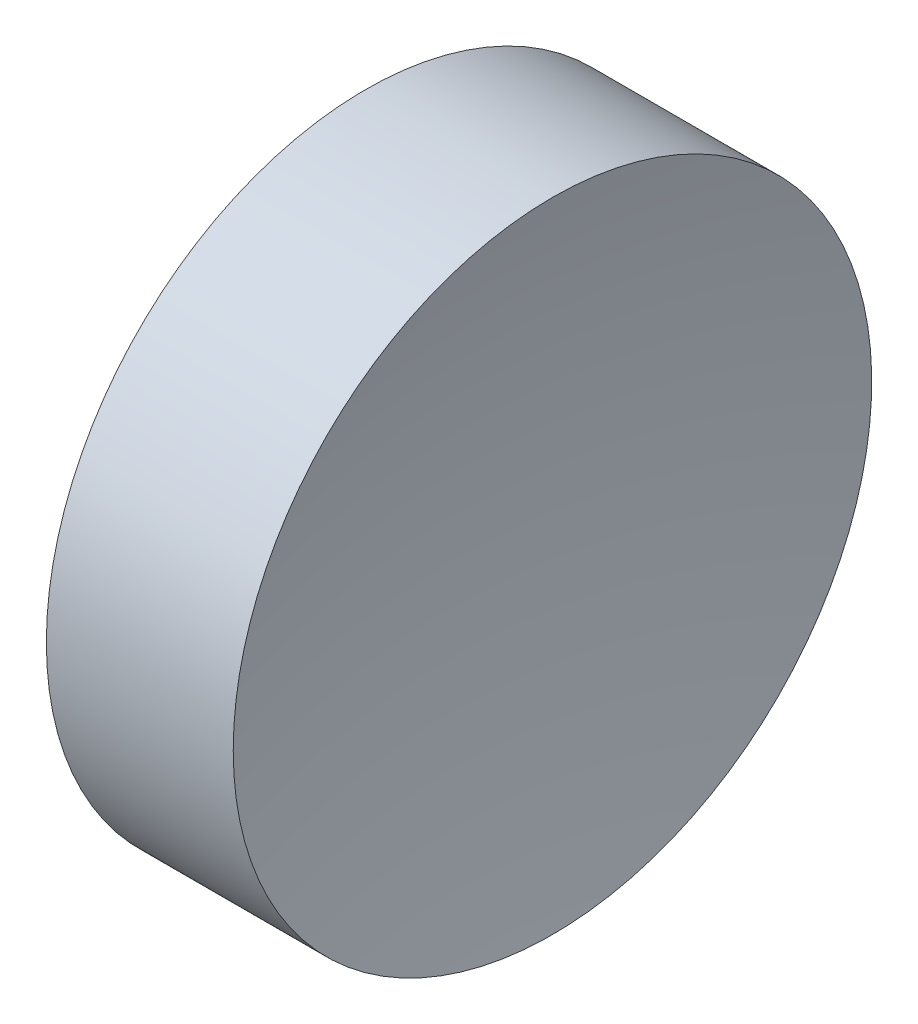
ISO-10303-21;
HEADER;
FILE_DESCRIPTION(('STEP AP214'),'2;1');
FILE_NAME('part.step','',(''),(''),'','','');
FILE_SCHEMA(('AUTOMOTIVE_DESIGN { 1 0 10303 214 1 1 1 1 }'));
ENDSEC;
DATA;
#1=APPLICATION_CONTEXT('core data for automotive mechanical design processes');
#2=APPLICATION_PROTOCOL_DEFINITION('international standard','automotive_design',2000,#1);
#3=PRODUCT_CONTEXT('',#1,'mechanical');
#4=PRODUCT('Part','Part','',(#3));
#5=PRODUCT_RELATED_PRODUCT_CATEGORY('part','',(#4));
#6=PRODUCT_DEFINITION_FORMATION('','',#4);
#7=PRODUCT_DEFINITION_CONTEXT('part definition',#1,'design');
#8=PRODUCT_DEFINITION('design','',#6,#7);
#9=PRODUCT_DEFINITION_SHAPE('','',#8);
#10=(LENGTH_UNIT() NAMED_UNIT(*) SI_UNIT(.MILLI.,.METRE.));
#11=(NAMED_UNIT(*) PLANE_ANGLE_UNIT() SI_UNIT($,.RADIAN.));
#12=(NAMED_UNIT(*) SI_UNIT($,.STERADIAN.) SOLID_ANGLE_UNIT());
#13=UNCERTAINTY_MEASURE_WITH_UNIT(LENGTH_MEASURE(1.E-05),#10,'distance_accuracy_value','');
#14=(GEOMETRIC_REPRESENTATION_CONTEXT(3) GLOBAL_UNCERTAINTY_ASSIGNED_CONTEXT((#13)) GLOBAL_UNIT_ASSIGNED_CONTEXT((#10,
#11,#12)) REPRESENTATION_CONTEXT('',''));
#15=CARTESIAN_POINT('',(0.,0.,0.));
#16=DIRECTION('',(0.,0.,1.));
#17=DIRECTION('',(1.,0.,0.));
#18=AXIS2_PLACEMENT_3D('',#15,#16,#17);
#19=CARTESIAN_POINT('',(90.5463277674595,34.6890105616862,0.));
#20=DIRECTION('',(-1.,0.,0.));
#21=DIRECTION('',(0.,1.,0.));
#22=AXIS2_PLACEMENT_3D('',#19,#20,#21);
#23=SPHERICAL_SURFACE('',#22,30.);
#24=CARTESIAN_POINT('',(61.2045912816958,34.6890105616862,0.));
#25=DIRECTION('',(-1.,0.,0.));
#26=DIRECTION('',(0.,0.,1.));
#27=AXIS2_PLACEMENT_3D('',#24,#25,#26);
#28=CIRCLE('',#27,6.25000000000001);
#29=CARTESIAN_POINT('',(61.2045912816958,34.6890105616862,6.25000000000001));
#30=VERTEX_POINT('',#29);
#31=EDGE_CURVE('E10',#30,#30,#28,.T.);
#32=ORIENTED_EDGE('',*,*,#31,.F.);
#33=EDGE_LOOP('',(#32));
#34=FACE_BOUND('',#33,.T.);
#35=ADVANCED_FACE('F35',(#34),#23,.F.);
#36=CARTESIAN_POINT('',(54.4925715010826,34.6890105616862,0.));
#37=DIRECTION('',(-1.,0.,0.));
#38=DIRECTION('',(0.,0.,1.));
#39=AXIS2_PLACEMENT_3D('',#36,#37,#38);
#40=CYLINDRICAL_SURFACE('',#39,6.25);
#41=CARTESIAN_POINT('',(57.5463277674598,34.6890105616862,0.));
#42=DIRECTION('',(-1.,0.,0.));
#43=DIRECTION('',(0.,0.,1.));
#44=AXIS2_PLACEMENT_3D('',#41,#42,#43);
#45=CIRCLE('',#44,6.25);
#46=CARTESIAN_POINT('',(57.5463277674598,34.6890105616862,6.25));
#47=VERTEX_POINT('',#46);
#48=EDGE_CURVE('E41',#47,#47,#45,.T.);
#49=ORIENTED_EDGE('',*,*,#48,.F.);
#50=EDGE_LOOP('',(#49));
#51=FACE_BOUND('',#50,.T.);
#52=ORIENTED_EDGE('',*,*,#31,.T.);
#53=EDGE_LOOP('',(#52));
#54=FACE_BOUND('',#53,.T.);
#55=ADVANCED_FACE('F49',(#51,#54),#40,.T.);
#56=CARTESIAN_POINT('',(57.5463277674598,34.6890105616862,0.));
#57=DIRECTION('',(1.,0.,0.));
#58=DIRECTION('',(0.,0.,-1.));
#59=AXIS2_PLACEMENT_3D('',#56,#57,#58);
#60=PLANE('',#59);
#61=ORIENTED_EDGE('',*,*,#48,.T.);
#62=EDGE_LOOP('',(#61));
#63=FACE_BOUND('',#62,.T.);
#64=ADVANCED_FACE('F47',(#63),#60,.F.);
#65=CLOSED_SHELL('',(#35,#55,#64));
#66=MANIFOLD_SOLID_BREP('B2',#65);
#67=ADVANCED_BREP_SHAPE_REPRESENTATION('',(#18,#66),#14);
#68=SHAPE_DEFINITION_REPRESENTATION(#9,#67);
ENDSEC;
END-ISO-10303-21;
